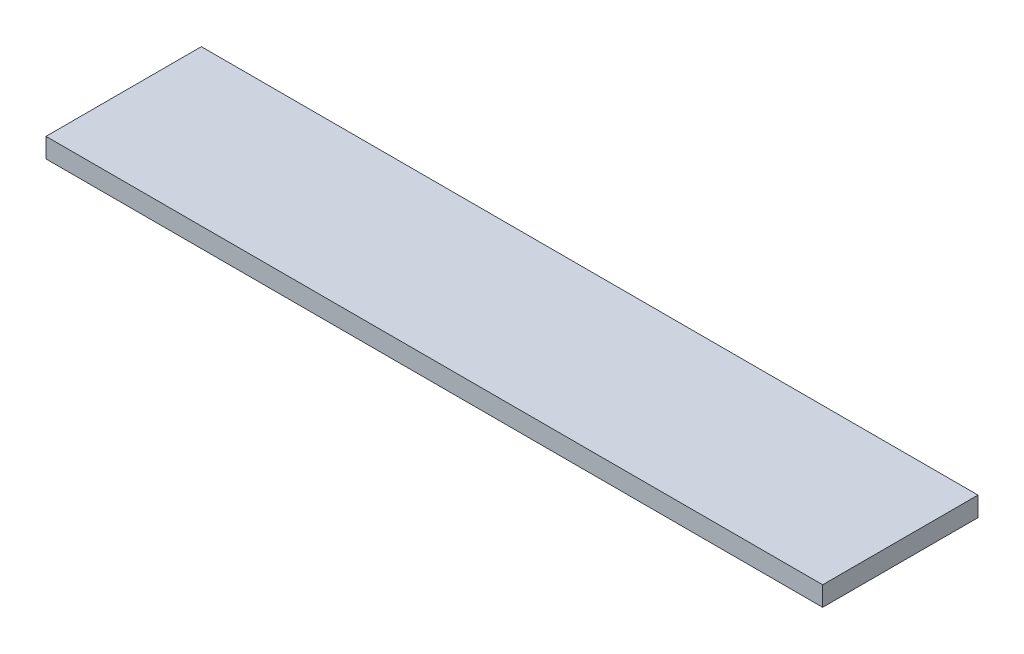
ISO-10303-21;
HEADER;
FILE_DESCRIPTION(('STEP AP214'),'2;1');
FILE_NAME('part.step','',(''),(''),'','','');
FILE_SCHEMA(('AUTOMOTIVE_DESIGN { 1 0 10303 214 1 1 1 1 }'));
ENDSEC;
DATA;
#1=APPLICATION_CONTEXT('core data for automotive mechanical design processes');
#2=APPLICATION_PROTOCOL_DEFINITION('international standard','automotive_design',2000,#1);
#3=PRODUCT_CONTEXT('',#1,'mechanical');
#4=PRODUCT('Part','Part','',(#3));
#5=PRODUCT_RELATED_PRODUCT_CATEGORY('part','',(#4));
#6=PRODUCT_DEFINITION_FORMATION('','',#4);
#7=PRODUCT_DEFINITION_CONTEXT('part definition',#1,'design');
#8=PRODUCT_DEFINITION('design','',#6,#7);
#9=PRODUCT_DEFINITION_SHAPE('','',#8);
#10=(LENGTH_UNIT() NAMED_UNIT(*) SI_UNIT(.MILLI.,.METRE.));
#11=(NAMED_UNIT(*) PLANE_ANGLE_UNIT() SI_UNIT($,.RADIAN.));
#12=(NAMED_UNIT(*) SI_UNIT($,.STERADIAN.) SOLID_ANGLE_UNIT());
#13=UNCERTAINTY_MEASURE_WITH_UNIT(LENGTH_MEASURE(1.E-05),#10,'distance_accuracy_value','');
#14=(GEOMETRIC_REPRESENTATION_CONTEXT(3) GLOBAL_UNCERTAINTY_ASSIGNED_CONTEXT((#13)) GLOBAL_UNIT_ASSIGNED_CONTEXT((#10,
#11,#12)) REPRESENTATION_CONTEXT('',''));
#15=CARTESIAN_POINT('',(0.,0.,0.));
#16=DIRECTION('',(0.,0.,1.));
#17=DIRECTION('',(1.,0.,0.));
#18=AXIS2_PLACEMENT_3D('',#15,#16,#17);
#19=CARTESIAN_POINT('',(-31.75,1.6002,6.35));
#20=DIRECTION('',(1.,0.,0.));
#21=DIRECTION('',(0.,0.,-1.));
#22=AXIS2_PLACEMENT_3D('',#19,#20,#21);
#23=PLANE('',#22);
#24=DIRECTION('',(0.,0.,1.));
#25=VECTOR('',#24,1.);
#26=CARTESIAN_POINT('',(-31.75,0.,6.35));
#27=LINE('',#26,#25);
#28=CARTESIAN_POINT('',(-31.75,0.,-6.35));
#29=VERTEX_POINT('',#28);
#30=CARTESIAN_POINT('',(-31.75,0.,6.35));
#31=VERTEX_POINT('',#30);
#32=EDGE_CURVE('E96',#29,#31,#27,.T.);
#33=ORIENTED_EDGE('',*,*,#32,.T.);
#34=DIRECTION('',(0.,-1.,0.));
#35=VECTOR('',#34,1.);
#36=CARTESIAN_POINT('',(-31.75,1.6002,6.35));
#37=LINE('',#36,#35);
#38=CARTESIAN_POINT('',(-31.75,1.6002,6.35));
#39=VERTEX_POINT('',#38);
#40=EDGE_CURVE('E11',#39,#31,#37,.T.);
#41=ORIENTED_EDGE('',*,*,#40,.F.);
#42=DIRECTION('',(0.,0.,1.));
#43=VECTOR('',#42,1.);
#44=CARTESIAN_POINT('',(-31.75,1.6002,6.35));
#45=LINE('',#44,#43);
#46=CARTESIAN_POINT('',(-31.75,1.6002,-6.35));
#47=VERTEX_POINT('',#46);
#48=EDGE_CURVE('E84',#47,#39,#45,.T.);
#49=ORIENTED_EDGE('',*,*,#48,.F.);
#50=DIRECTION('',(0.,-1.,0.));
#51=VECTOR('',#50,1.);
#52=CARTESIAN_POINT('',(-31.75,1.6002,-6.35));
#53=LINE('',#52,#51);
#54=EDGE_CURVE('E92',#47,#29,#53,.T.);
#55=ORIENTED_EDGE('',*,*,#54,.T.);
#56=EDGE_LOOP('',(#33,#41,#49,#55));
#57=FACE_BOUND('',#56,.T.);
#58=ADVANCED_FACE('F33',(#57),#23,.F.);
#59=CARTESIAN_POINT('',(31.75,1.6002,6.35));
#60=DIRECTION('',(0.,0.,-1.));
#61=DIRECTION('',(-1.,0.,0.));
#62=AXIS2_PLACEMENT_3D('',#59,#60,#61);
#63=PLANE('',#62);
#64=DIRECTION('',(1.,0.,0.));
#65=VECTOR('',#64,1.);
#66=CARTESIAN_POINT('',(31.75,0.,6.35));
#67=LINE('',#66,#65);
#68=CARTESIAN_POINT('',(31.75,0.,6.35));
#69=VERTEX_POINT('',#68);
#70=EDGE_CURVE('E88',#31,#69,#67,.T.);
#71=ORIENTED_EDGE('',*,*,#70,.T.);
#72=DIRECTION('',(0.,-1.,0.));
#73=VECTOR('',#72,1.);
#74=CARTESIAN_POINT('',(31.75,1.6002,6.35));
#75=LINE('',#74,#73);
#76=CARTESIAN_POINT('',(31.75,1.6002,6.35));
#77=VERTEX_POINT('',#76);
#78=EDGE_CURVE('E41',#77,#69,#75,.T.);
#79=ORIENTED_EDGE('',*,*,#78,.F.);
#80=DIRECTION('',(1.,0.,0.));
#81=VECTOR('',#80,1.);
#82=CARTESIAN_POINT('',(31.75,1.6002,6.35));
#83=LINE('',#82,#81);
#84=EDGE_CURVE('E79',#39,#77,#83,.T.);
#85=ORIENTED_EDGE('',*,*,#84,.F.);
#86=ORIENTED_EDGE('',*,*,#40,.T.);
#87=EDGE_LOOP('',(#71,#79,#85,#86));
#88=FACE_BOUND('',#87,.T.);
#89=ADVANCED_FACE('F87',(#88),#63,.F.);
#90=CARTESIAN_POINT('',(31.75,1.6002,6.35));
#91=DIRECTION('',(-1.,0.,0.));
#92=DIRECTION('',(0.,0.,1.));
#93=AXIS2_PLACEMENT_3D('',#90,#91,#92);
#94=PLANE('',#93);
#95=DIRECTION('',(0.,0.,-1.));
#96=VECTOR('',#95,1.);
#97=CARTESIAN_POINT('',(31.75,0.,6.35));
#98=LINE('',#97,#96);
#99=CARTESIAN_POINT('',(31.75,0.,-6.35));
#100=VERTEX_POINT('',#99);
#101=EDGE_CURVE('E66',#69,#100,#98,.T.);
#102=ORIENTED_EDGE('',*,*,#101,.T.);
#103=DIRECTION('',(0.,-1.,0.));
#104=VECTOR('',#103,1.);
#105=CARTESIAN_POINT('',(31.75,1.6002,-6.35));
#106=LINE('',#105,#104);
#107=CARTESIAN_POINT('',(31.75,1.6002,-6.35));
#108=VERTEX_POINT('',#107);
#109=EDGE_CURVE('E89',#108,#100,#106,.T.);
#110=ORIENTED_EDGE('',*,*,#109,.F.);
#111=DIRECTION('',(0.,0.,-1.));
#112=VECTOR('',#111,1.);
#113=CARTESIAN_POINT('',(31.75,1.6002,6.35));
#114=LINE('',#113,#112);
#115=EDGE_CURVE('E82',#77,#108,#114,.T.);
#116=ORIENTED_EDGE('',*,*,#115,.F.);
#117=ORIENTED_EDGE('',*,*,#78,.T.);
#118=EDGE_LOOP('',(#102,#110,#116,#117));
#119=FACE_BOUND('',#118,.T.);
#120=ADVANCED_FACE('F90',(#119),#94,.F.);
#121=CARTESIAN_POINT('',(31.75,1.6002,-6.35));
#122=DIRECTION('',(0.,0.,1.));
#123=DIRECTION('',(1.,0.,0.));
#124=AXIS2_PLACEMENT_3D('',#121,#122,#123);
#125=PLANE('',#124);
#126=DIRECTION('',(-1.,0.,0.));
#127=VECTOR('',#126,1.);
#128=CARTESIAN_POINT('',(31.75,0.,-6.35));
#129=LINE('',#128,#127);
#130=EDGE_CURVE('E72',#100,#29,#129,.T.);
#131=ORIENTED_EDGE('',*,*,#130,.T.);
#132=ORIENTED_EDGE('',*,*,#54,.F.);
#133=DIRECTION('',(-1.,0.,0.));
#134=VECTOR('',#133,1.);
#135=CARTESIAN_POINT('',(31.75,1.6002,-6.35));
#136=LINE('',#135,#134);
#137=EDGE_CURVE('E49',#108,#47,#136,.T.);
#138=ORIENTED_EDGE('',*,*,#137,.F.);
#139=ORIENTED_EDGE('',*,*,#109,.T.);
#140=EDGE_LOOP('',(#131,#132,#138,#139));
#141=FACE_BOUND('',#140,.T.);
#142=ADVANCED_FACE('F103',(#141),#125,.F.);
#143=CARTESIAN_POINT('',(-31.75,1.6002,-6.35));
#144=DIRECTION('',(0.,1.,0.));
#145=DIRECTION('',(0.,0.,1.));
#146=AXIS2_PLACEMENT_3D('',#143,#144,#145);
#147=PLANE('',#146);
#148=ORIENTED_EDGE('',*,*,#48,.T.);
#149=ORIENTED_EDGE('',*,*,#84,.T.);
#150=ORIENTED_EDGE('',*,*,#115,.T.);
#151=ORIENTED_EDGE('',*,*,#137,.T.);
#152=EDGE_LOOP('',(#148,#149,#150,#151));
#153=FACE_BOUND('',#152,.T.);
#154=ADVANCED_FACE('F80',(#153),#147,.T.);
#155=CARTESIAN_POINT('',(-31.75,0.,-6.35));
#156=DIRECTION('',(0.,1.,0.));
#157=DIRECTION('',(0.,0.,1.));
#158=AXIS2_PLACEMENT_3D('',#155,#156,#157);
#159=PLANE('',#158);
#160=ORIENTED_EDGE('',*,*,#32,.F.);
#161=ORIENTED_EDGE('',*,*,#130,.F.);
#162=ORIENTED_EDGE('',*,*,#101,.F.);
#163=ORIENTED_EDGE('',*,*,#70,.F.);
#164=EDGE_LOOP('',(#160,#161,#162,#163));
#165=FACE_BOUND('',#164,.T.);
#166=ADVANCED_FACE('F106',(#165),#159,.F.);
#167=CLOSED_SHELL('',(#58,#89,#120,#142,#154,#166));
#168=MANIFOLD_SOLID_BREP('B2',#167);
#169=ADVANCED_BREP_SHAPE_REPRESENTATION('',(#18,#168),#14);
#170=SHAPE_DEFINITION_REPRESENTATION(#9,#169);
ENDSEC;
END-ISO-10303-21;
